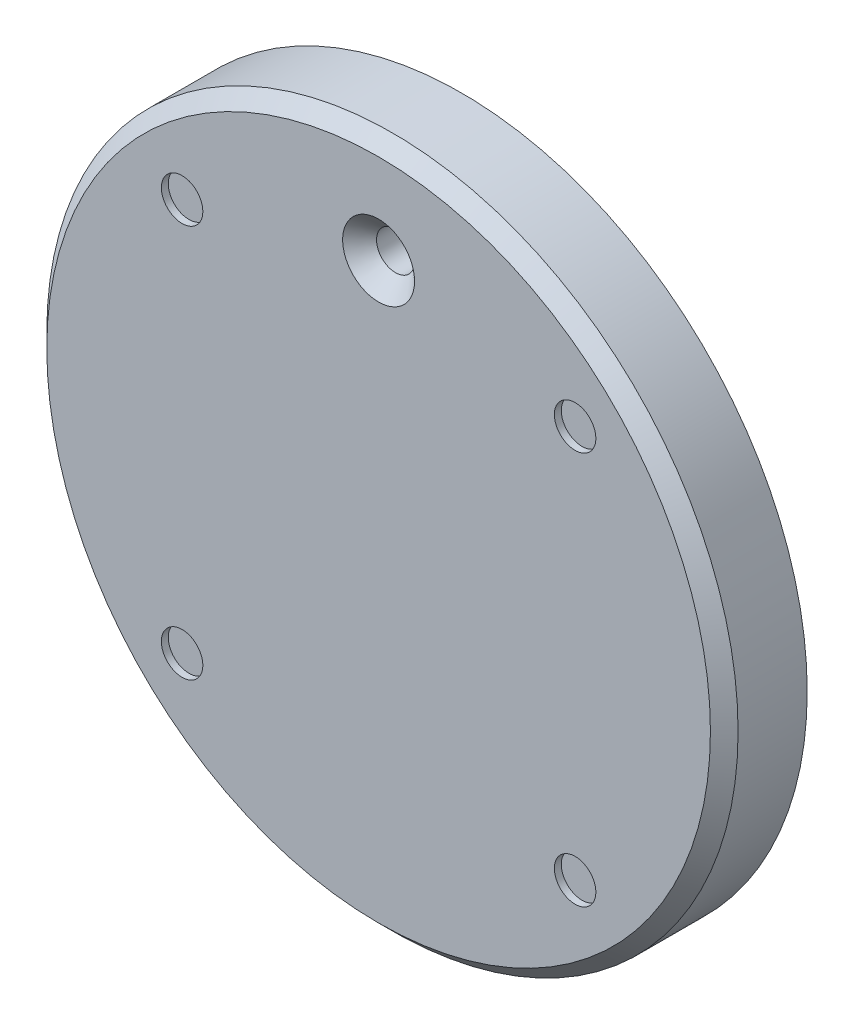
ISO-10303-21;
HEADER;
FILE_DESCRIPTION(('STEP AP214'),'2;1');
FILE_NAME('part.step','',(''),(''),'','','');
FILE_SCHEMA(('AUTOMOTIVE_DESIGN { 1 0 10303 214 1 1 1 1 }'));
ENDSEC;
DATA;
#1=APPLICATION_CONTEXT('core data for automotive mechanical design processes');
#2=APPLICATION_PROTOCOL_DEFINITION('international standard','automotive_design',2000,#1);
#3=PRODUCT_CONTEXT('',#1,'mechanical');
#4=PRODUCT('Part','Part','',(#3));
#5=PRODUCT_RELATED_PRODUCT_CATEGORY('part','',(#4));
#6=PRODUCT_DEFINITION_FORMATION('','',#4);
#7=PRODUCT_DEFINITION_CONTEXT('part definition',#1,'design');
#8=PRODUCT_DEFINITION('design','',#6,#7);
#9=PRODUCT_DEFINITION_SHAPE('','',#8);
#10=(LENGTH_UNIT() NAMED_UNIT(*) SI_UNIT(.MILLI.,.METRE.));
#11=(NAMED_UNIT(*) PLANE_ANGLE_UNIT() SI_UNIT($,.RADIAN.));
#12=(NAMED_UNIT(*) SI_UNIT($,.STERADIAN.) SOLID_ANGLE_UNIT());
#13=UNCERTAINTY_MEASURE_WITH_UNIT(LENGTH_MEASURE(1.E-05),#10,'distance_accuracy_value','');
#14=(GEOMETRIC_REPRESENTATION_CONTEXT(3) GLOBAL_UNCERTAINTY_ASSIGNED_CONTEXT((#13)) GLOBAL_UNIT_ASSIGNED_CONTEXT((#10,
#11,#12)) REPRESENTATION_CONTEXT('',''));
#15=CARTESIAN_POINT('',(0.,0.,0.));
#16=DIRECTION('',(0.,0.,1.));
#17=DIRECTION('',(1.,0.,0.));
#18=AXIS2_PLACEMENT_3D('',#15,#16,#17);
#19=CARTESIAN_POINT('',(0.,0.,12.));
#20=DIRECTION('',(0.,0.,-1.));
#21=DIRECTION('',(-1.,0.,0.));
#22=AXIS2_PLACEMENT_3D('',#19,#20,#21);
#23=CYLINDRICAL_SURFACE('',#22,50.);
#24=CARTESIAN_POINT('',(0.,0.,9.99999999999999));
#25=DIRECTION('',(0.,0.,1.));
#26=DIRECTION('',(1.,0.,0.));
#27=AXIS2_PLACEMENT_3D('',#24,#25,#26);
#28=CIRCLE('',#27,50.);
#29=CARTESIAN_POINT('',(50.,0.,9.99999999999999));
#30=VERTEX_POINT('',#29);
#31=EDGE_CURVE('E10',#30,#30,#28,.F.);
#32=ORIENTED_EDGE('',*,*,#31,.T.);
#33=EDGE_LOOP('',(#32));
#34=FACE_BOUND('',#33,.T.);
#35=CARTESIAN_POINT('',(0.,0.,0.));
#36=DIRECTION('',(0.,0.,1.));
#37=DIRECTION('',(1.,0.,0.));
#38=AXIS2_PLACEMENT_3D('',#35,#36,#37);
#39=CIRCLE('',#38,50.);
#40=CARTESIAN_POINT('',(50.,0.,0.));
#41=VERTEX_POINT('',#40);
#42=EDGE_CURVE('E58',#41,#41,#39,.T.);
#43=ORIENTED_EDGE('',*,*,#42,.T.);
#44=EDGE_LOOP('',(#43));
#45=FACE_BOUND('',#44,.T.);
#46=ADVANCED_FACE('F44',(#34,#45),#23,.T.);
#47=CARTESIAN_POINT('',(0.,0.,12.));
#48=DIRECTION('',(0.,0.,1.));
#49=DIRECTION('',(1.,0.,0.));
#50=AXIS2_PLACEMENT_3D('',#47,#48,#49);
#51=PLANE('',#50);
#52=CARTESIAN_POINT('',(0.,0.,12.));
#53=DIRECTION('',(0.,0.,1.));
#54=DIRECTION('',(1.,0.,0.));
#55=AXIS2_PLACEMENT_3D('',#52,#53,#54);
#56=CIRCLE('',#55,48.);
#57=CARTESIAN_POINT('',(48.,0.,12.));
#58=VERTEX_POINT('',#57);
#59=EDGE_CURVE('E53',#58,#58,#56,.T.);
#60=ORIENTED_EDGE('',*,*,#59,.T.);
#61=EDGE_LOOP('',(#60));
#62=FACE_BOUND('',#61,.T.);
#63=CARTESIAN_POINT('',(-28.4256926036995,-28.4256926036989,12.));
#64=DIRECTION('',(0.,0.,1.));
#65=DIRECTION('',(1.,0.,0.));
#66=AXIS2_PLACEMENT_3D('',#63,#64,#65);
#67=CIRCLE('',#66,2.99999999999999);
#68=CARTESIAN_POINT('',(-25.4256926036995,-28.4256926036989,12.));
#69=VERTEX_POINT('',#68);
#70=EDGE_CURVE('E90',#69,#69,#67,.T.);
#71=ORIENTED_EDGE('',*,*,#70,.F.);
#72=EDGE_LOOP('',(#71));
#73=FACE_BOUND('',#72,.T.);
#74=CARTESIAN_POINT('',(28.425692603699,-28.4256926036994,12.));
#75=DIRECTION('',(0.,0.,1.));
#76=DIRECTION('',(1.,0.,0.));
#77=AXIS2_PLACEMENT_3D('',#74,#75,#76);
#78=CIRCLE('',#77,2.99999999999999);
#79=CARTESIAN_POINT('',(31.425692603699,-28.4256926036994,12.));
#80=VERTEX_POINT('',#79);
#81=EDGE_CURVE('E98',#80,#80,#78,.T.);
#82=ORIENTED_EDGE('',*,*,#81,.F.);
#83=EDGE_LOOP('',(#82));
#84=FACE_BOUND('',#83,.T.);
#85=CARTESIAN_POINT('',(28.4256926036993,28.4256926036991,12.));
#86=DIRECTION('',(0.,0.,1.));
#87=DIRECTION('',(1.,0.,0.));
#88=AXIS2_PLACEMENT_3D('',#85,#86,#87);
#89=CIRCLE('',#88,2.99999999999999);
#90=CARTESIAN_POINT('',(31.4256926036993,28.4256926036991,12.));
#91=VERTEX_POINT('',#90);
#92=EDGE_CURVE('E82',#91,#91,#89,.T.);
#93=ORIENTED_EDGE('',*,*,#92,.F.);
#94=EDGE_LOOP('',(#93));
#95=FACE_BOUND('',#94,.T.);
#96=CARTESIAN_POINT('',(-28.4256926036992,28.4256926036992,12.));
#97=DIRECTION('',(0.,0.,1.));
#98=DIRECTION('',(1.,0.,0.));
#99=AXIS2_PLACEMENT_3D('',#96,#97,#98);
#100=CIRCLE('',#99,2.99999999999999);
#101=CARTESIAN_POINT('',(-25.4256926036992,28.4256926036992,12.));
#102=VERTEX_POINT('',#101);
#103=EDGE_CURVE('E78',#102,#102,#100,.T.);
#104=ORIENTED_EDGE('',*,*,#103,.F.);
#105=EDGE_LOOP('',(#104));
#106=FACE_BOUND('',#105,.T.);
#107=CARTESIAN_POINT('',(0.,35.,12.));
#108=DIRECTION('',(0.,0.,1.));
#109=DIRECTION('',(1.,0.,0.));
#110=AXIS2_PLACEMENT_3D('',#107,#108,#109);
#111=CIRCLE('',#110,5.2);
#112=CARTESIAN_POINT('',(5.2,35.,12.));
#113=VERTEX_POINT('',#112);
#114=EDGE_CURVE('E73',#113,#113,#111,.T.);
#115=ORIENTED_EDGE('',*,*,#114,.F.);
#116=EDGE_LOOP('',(#115));
#117=FACE_BOUND('',#116,.T.);
#118=ADVANCED_FACE('F112',(#62,#73,#84,#95,#106,#117),#51,.T.);
#119=CARTESIAN_POINT('',(0.,0.,0.));
#120=DIRECTION('',(0.,0.,1.));
#121=DIRECTION('',(1.,0.,0.));
#122=AXIS2_PLACEMENT_3D('',#119,#120,#121);
#123=PLANE('',#122);
#124=CARTESIAN_POINT('',(0.,35.,0.));
#125=DIRECTION('',(0.,0.,1.));
#126=DIRECTION('',(1.,0.,0.));
#127=AXIS2_PLACEMENT_3D('',#124,#125,#126);
#128=CIRCLE('',#127,2.75);
#129=CARTESIAN_POINT('',(2.75,35.,0.));
#130=VERTEX_POINT('',#129);
#131=EDGE_CURVE('E63',#130,#130,#128,.T.);
#132=ORIENTED_EDGE('',*,*,#131,.T.);
#133=EDGE_LOOP('',(#132));
#134=FACE_BOUND('',#133,.T.);
#135=ORIENTED_EDGE('',*,*,#42,.F.);
#136=EDGE_LOOP('',(#135));
#137=FACE_BOUND('',#136,.T.);
#138=ADVANCED_FACE('F115',(#134,#137),#123,.F.);
#139=CARTESIAN_POINT('',(0.,35.,12.));
#140=DIRECTION('',(0.,0.,1.));
#141=DIRECTION('',(1.,0.,0.));
#142=AXIS2_PLACEMENT_3D('',#139,#140,#141);
#143=CYLINDRICAL_SURFACE('',#142,2.75);
#144=ORIENTED_EDGE('',*,*,#131,.F.);
#145=EDGE_LOOP('',(#144));
#146=FACE_BOUND('',#145,.T.);
#147=CARTESIAN_POINT('',(0.,35.,9.55));
#148=DIRECTION('',(0.,0.,1.));
#149=DIRECTION('',(1.,0.,0.));
#150=AXIS2_PLACEMENT_3D('',#147,#148,#149);
#151=CIRCLE('',#150,2.75);
#152=CARTESIAN_POINT('',(2.75,35.,9.55));
#153=VERTEX_POINT('',#152);
#154=EDGE_CURVE('E69',#153,#153,#151,.T.);
#155=ORIENTED_EDGE('',*,*,#154,.T.);
#156=EDGE_LOOP('',(#155));
#157=FACE_BOUND('',#156,.T.);
#158=ADVANCED_FACE('F124',(#146,#157),#143,.F.);
#159=CARTESIAN_POINT('',(0.,35.,12.));
#160=DIRECTION('',(0.,0.,1.));
#161=DIRECTION('',(1.,0.,0.));
#162=AXIS2_PLACEMENT_3D('',#159,#160,#161);
#163=CONICAL_SURFACE('',#162,5.2,0.785398163397448);
#164=ORIENTED_EDGE('',*,*,#154,.F.);
#165=EDGE_LOOP('',(#164));
#166=FACE_BOUND('',#165,.T.);
#167=ORIENTED_EDGE('',*,*,#114,.T.);
#168=EDGE_LOOP('',(#167));
#169=FACE_BOUND('',#168,.T.);
#170=ADVANCED_FACE('F121',(#166,#169),#163,.F.);
#171=CARTESIAN_POINT('',(-28.4256926036992,28.4256926036992,11.));
#172=DIRECTION('',(0.,0.,1.));
#173=DIRECTION('',(1.,0.,0.));
#174=AXIS2_PLACEMENT_3D('',#171,#172,#173);
#175=CYLINDRICAL_SURFACE('',#174,2.99999999999999);
#176=CARTESIAN_POINT('',(-28.4256926036992,28.4256926036992,11.));
#177=DIRECTION('',(0.,0.,1.));
#178=DIRECTION('',(1.,0.,0.));
#179=AXIS2_PLACEMENT_3D('',#176,#177,#178);
#180=CIRCLE('',#179,2.99999999999999);
#181=CARTESIAN_POINT('',(-25.4256926036992,28.4256926036992,11.));
#182=VERTEX_POINT('',#181);
#183=EDGE_CURVE('E77',#182,#182,#180,.T.);
#184=ORIENTED_EDGE('',*,*,#183,.F.);
#185=EDGE_LOOP('',(#184));
#186=FACE_BOUND('',#185,.T.);
#187=ORIENTED_EDGE('',*,*,#103,.T.);
#188=EDGE_LOOP('',(#187));
#189=FACE_BOUND('',#188,.T.);
#190=ADVANCED_FACE('F123',(#186,#189),#175,.F.);
#191=CARTESIAN_POINT('',(-28.4256926036992,28.4256926036992,11.));
#192=DIRECTION('',(0.,0.,1.));
#193=DIRECTION('',(1.,0.,0.));
#194=AXIS2_PLACEMENT_3D('',#191,#192,#193);
#195=PLANE('',#194);
#196=ORIENTED_EDGE('',*,*,#183,.T.);
#197=EDGE_LOOP('',(#196));
#198=FACE_BOUND('',#197,.T.);
#199=ADVANCED_FACE('F131',(#198),#195,.T.);
#200=CARTESIAN_POINT('',(28.4256926036993,28.4256926036991,11.));
#201=DIRECTION('',(0.,0.,1.));
#202=DIRECTION('',(1.,0.,0.));
#203=AXIS2_PLACEMENT_3D('',#200,#201,#202);
#204=CYLINDRICAL_SURFACE('',#203,2.99999999999999);
#205=CARTESIAN_POINT('',(28.4256926036993,28.4256926036991,11.));
#206=DIRECTION('',(0.,0.,1.));
#207=DIRECTION('',(1.,0.,0.));
#208=AXIS2_PLACEMENT_3D('',#205,#206,#207);
#209=CIRCLE('',#208,2.99999999999999);
#210=CARTESIAN_POINT('',(31.4256926036993,28.4256926036991,11.));
#211=VERTEX_POINT('',#210);
#212=EDGE_CURVE('E102',#211,#211,#209,.T.);
#213=ORIENTED_EDGE('',*,*,#212,.F.);
#214=EDGE_LOOP('',(#213));
#215=FACE_BOUND('',#214,.T.);
#216=ORIENTED_EDGE('',*,*,#92,.T.);
#217=EDGE_LOOP('',(#216));
#218=FACE_BOUND('',#217,.T.);
#219=ADVANCED_FACE('F110',(#215,#218),#204,.F.);
#220=CARTESIAN_POINT('',(28.4256926036993,28.4256926036991,11.));
#221=DIRECTION('',(0.,0.,1.));
#222=DIRECTION('',(1.,0.,0.));
#223=AXIS2_PLACEMENT_3D('',#220,#221,#222);
#224=PLANE('',#223);
#225=ORIENTED_EDGE('',*,*,#212,.T.);
#226=EDGE_LOOP('',(#225));
#227=FACE_BOUND('',#226,.T.);
#228=ADVANCED_FACE('F184',(#227),#224,.T.);
#229=CARTESIAN_POINT('',(28.425692603699,-28.4256926036994,11.));
#230=DIRECTION('',(0.,0.,1.));
#231=DIRECTION('',(1.,0.,0.));
#232=AXIS2_PLACEMENT_3D('',#229,#230,#231);
#233=CYLINDRICAL_SURFACE('',#232,2.99999999999999);
#234=CARTESIAN_POINT('',(28.425692603699,-28.4256926036994,11.));
#235=DIRECTION('',(0.,0.,1.));
#236=DIRECTION('',(1.,0.,0.));
#237=AXIS2_PLACEMENT_3D('',#234,#235,#236);
#238=CIRCLE('',#237,2.99999999999999);
#239=CARTESIAN_POINT('',(31.425692603699,-28.4256926036994,11.));
#240=VERTEX_POINT('',#239);
#241=EDGE_CURVE('E94',#240,#240,#238,.T.);
#242=ORIENTED_EDGE('',*,*,#241,.F.);
#243=EDGE_LOOP('',(#242));
#244=FACE_BOUND('',#243,.T.);
#245=ORIENTED_EDGE('',*,*,#81,.T.);
#246=EDGE_LOOP('',(#245));
#247=FACE_BOUND('',#246,.T.);
#248=ADVANCED_FACE('F194',(#244,#247),#233,.F.);
#249=CARTESIAN_POINT('',(28.425692603699,-28.4256926036994,11.));
#250=DIRECTION('',(0.,0.,1.));
#251=DIRECTION('',(1.,0.,0.));
#252=AXIS2_PLACEMENT_3D('',#249,#250,#251);
#253=PLANE('',#252);
#254=ORIENTED_EDGE('',*,*,#241,.T.);
#255=EDGE_LOOP('',(#254));
#256=FACE_BOUND('',#255,.T.);
#257=ADVANCED_FACE('F204',(#256),#253,.T.);
#258=CARTESIAN_POINT('',(-28.4256926036995,-28.4256926036989,11.));
#259=DIRECTION('',(0.,0.,1.));
#260=DIRECTION('',(1.,0.,0.));
#261=AXIS2_PLACEMENT_3D('',#258,#259,#260);
#262=CYLINDRICAL_SURFACE('',#261,2.99999999999999);
#263=CARTESIAN_POINT('',(-28.4256926036995,-28.4256926036989,11.));
#264=DIRECTION('',(0.,0.,1.));
#265=DIRECTION('',(1.,0.,0.));
#266=AXIS2_PLACEMENT_3D('',#263,#264,#265);
#267=CIRCLE('',#266,2.99999999999999);
#268=CARTESIAN_POINT('',(-25.4256926036995,-28.4256926036989,11.));
#269=VERTEX_POINT('',#268);
#270=EDGE_CURVE('E86',#269,#269,#267,.T.);
#271=ORIENTED_EDGE('',*,*,#270,.F.);
#272=EDGE_LOOP('',(#271));
#273=FACE_BOUND('',#272,.T.);
#274=ORIENTED_EDGE('',*,*,#70,.T.);
#275=EDGE_LOOP('',(#274));
#276=FACE_BOUND('',#275,.T.);
#277=ADVANCED_FACE('F214',(#273,#276),#262,.F.);
#278=CARTESIAN_POINT('',(-28.4256926036995,-28.4256926036989,11.));
#279=DIRECTION('',(0.,0.,1.));
#280=DIRECTION('',(1.,0.,0.));
#281=AXIS2_PLACEMENT_3D('',#278,#279,#280);
#282=PLANE('',#281);
#283=ORIENTED_EDGE('',*,*,#270,.T.);
#284=EDGE_LOOP('',(#283));
#285=FACE_BOUND('',#284,.T.);
#286=ADVANCED_FACE('F224',(#285),#282,.T.);
#287=CARTESIAN_POINT('',(0.,0.,12.));
#288=DIRECTION('',(0.,0.,-1.));
#289=DIRECTION('',(-1.,0.,0.));
#290=AXIS2_PLACEMENT_3D('',#287,#288,#289);
#291=CONICAL_SURFACE('',#290,48.,0.78539816339745);
#292=ORIENTED_EDGE('',*,*,#31,.F.);
#293=EDGE_LOOP('',(#292));
#294=FACE_BOUND('',#293,.T.);
#295=ORIENTED_EDGE('',*,*,#59,.F.);
#296=EDGE_LOOP('',(#295));
#297=FACE_BOUND('',#296,.T.);
#298=ADVANCED_FACE('F47',(#294,#297),#291,.T.);
#299=CLOSED_SHELL('',(#46,#118,#138,#158,#170,#190,#199,#219,#228,#248,#257,#277,#286,#298));
#300=MANIFOLD_SOLID_BREP('B2',#299);
#301=ADVANCED_BREP_SHAPE_REPRESENTATION('',(#18,#300),#14);
#302=SHAPE_DEFINITION_REPRESENTATION(#9,#301);
ENDSEC;
END-ISO-10303-21;
